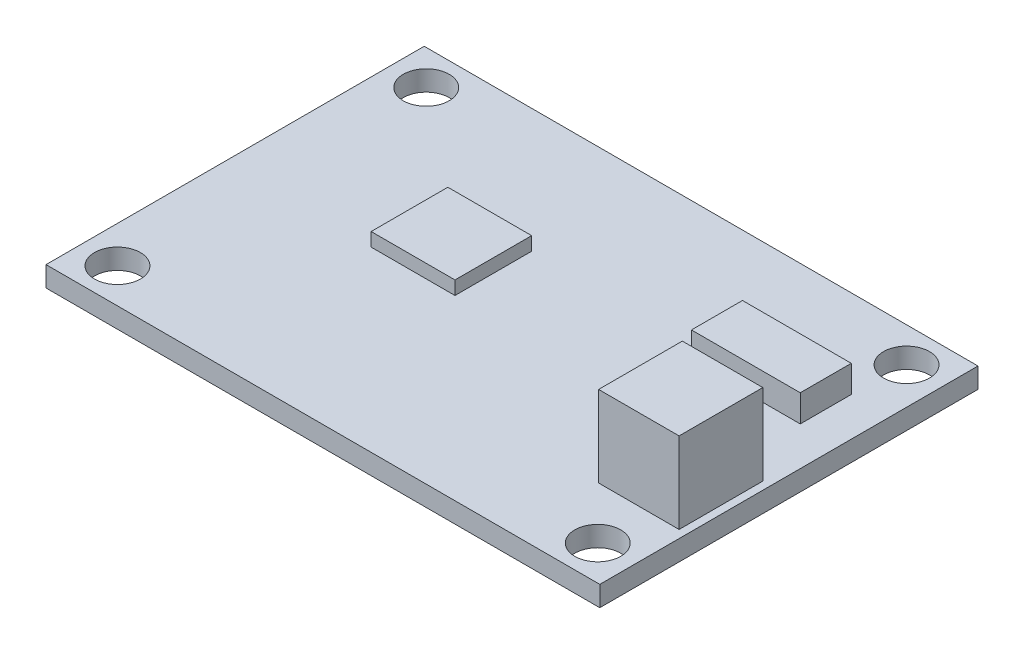
ISO-10303-21;
HEADER;
FILE_DESCRIPTION(('STEP AP214'),'2;1');
FILE_NAME('part.step','',(''),(''),'','','');
FILE_SCHEMA(('AUTOMOTIVE_DESIGN { 1 0 10303 214 1 1 1 1 }'));
ENDSEC;
DATA;
#1=APPLICATION_CONTEXT('core data for automotive mechanical design processes');
#2=APPLICATION_PROTOCOL_DEFINITION('international standard','automotive_design',2000,#1);
#3=PRODUCT_CONTEXT('',#1,'mechanical');
#4=PRODUCT('Part','Part','',(#3));
#5=PRODUCT_RELATED_PRODUCT_CATEGORY('part','',(#4));
#6=PRODUCT_DEFINITION_FORMATION('','',#4);
#7=PRODUCT_DEFINITION_CONTEXT('part definition',#1,'design');
#8=PRODUCT_DEFINITION('design','',#6,#7);
#9=PRODUCT_DEFINITION_SHAPE('','',#8);
#10=(LENGTH_UNIT() NAMED_UNIT(*) SI_UNIT(.MILLI.,.METRE.));
#11=(NAMED_UNIT(*) PLANE_ANGLE_UNIT() SI_UNIT($,.RADIAN.));
#12=(NAMED_UNIT(*) SI_UNIT($,.STERADIAN.) SOLID_ANGLE_UNIT());
#13=UNCERTAINTY_MEASURE_WITH_UNIT(LENGTH_MEASURE(1.E-05),#10,'distance_accuracy_value','');
#14=(GEOMETRIC_REPRESENTATION_CONTEXT(3) GLOBAL_UNCERTAINTY_ASSIGNED_CONTEXT((#13)) GLOBAL_UNIT_ASSIGNED_CONTEXT((#10,
#11,#12)) REPRESENTATION_CONTEXT('',''));
#15=CARTESIAN_POINT('',(0.,0.,0.));
#16=DIRECTION('',(0.,0.,1.));
#17=DIRECTION('',(1.,0.,0.));
#18=AXIS2_PLACEMENT_3D('',#15,#16,#17);
#19=CARTESIAN_POINT('',(0.,1.5,0.));
#20=DIRECTION('',(0.,1.,0.));
#21=DIRECTION('',(0.,0.,1.));
#22=AXIS2_PLACEMENT_3D('',#19,#20,#21);
#23=PLANE('',#22);
#24=DIRECTION('',(-1.,0.,0.));
#25=VECTOR('',#24,1.);
#26=CARTESIAN_POINT('',(13.9582344119431,1.5,1.34779727104624));
#27=LINE('',#26,#25);
#28=CARTESIAN_POINT('',(19.9164808427399,1.5,1.34779727104624));
#29=VERTEX_POINT('',#28);
#30=CARTESIAN_POINT('',(13.9582344119431,1.5,1.34779727104624));
#31=VERTEX_POINT('',#30);
#32=EDGE_CURVE('E177',#29,#31,#27,.T.);
#33=ORIENTED_EDGE('',*,*,#32,.F.);
#34=DIRECTION('',(0.,0.,-1.));
#35=VECTOR('',#34,1.);
#36=CARTESIAN_POINT('',(19.9164808427399,1.5,7.54614927527645));
#37=LINE('',#36,#35);
#38=CARTESIAN_POINT('',(19.9164808427399,1.5,7.54614927527645));
#39=VERTEX_POINT('',#38);
#40=EDGE_CURVE('E174',#39,#29,#37,.T.);
#41=ORIENTED_EDGE('',*,*,#40,.F.);
#42=DIRECTION('',(1.,0.,0.));
#43=VECTOR('',#42,1.);
#44=CARTESIAN_POINT('',(13.9582344119431,1.5,7.54614927527645));
#45=LINE('',#44,#43);
#46=CARTESIAN_POINT('',(13.9582344119431,1.5,7.54614927527645));
#47=VERTEX_POINT('',#46);
#48=EDGE_CURVE('E186',#47,#39,#45,.T.);
#49=ORIENTED_EDGE('',*,*,#48,.F.);
#50=DIRECTION('',(0.,0.,1.));
#51=VECTOR('',#50,1.);
#52=CARTESIAN_POINT('',(13.9582344119431,1.5,7.54614927527645));
#53=LINE('',#52,#51);
#54=EDGE_CURVE('E194',#31,#47,#53,.T.);
#55=ORIENTED_EDGE('',*,*,#54,.F.);
#56=EDGE_LOOP('',(#33,#41,#49,#55));
#57=FACE_BOUND('',#56,.T.);
#58=DIRECTION('',(0.,0.,1.));
#59=VECTOR('',#58,1.);
#60=CARTESIAN_POINT('',(-20.5,1.5,14.));
#61=LINE('',#60,#59);
#62=CARTESIAN_POINT('',(-20.5,1.5,-14.));
#63=VERTEX_POINT('',#62);
#64=CARTESIAN_POINT('',(-20.5,1.5,14.));
#65=VERTEX_POINT('',#64);
#66=EDGE_CURVE('E259',#63,#65,#61,.T.);
#67=ORIENTED_EDGE('',*,*,#66,.T.);
#68=DIRECTION('',(1.,0.,0.));
#69=VECTOR('',#68,1.);
#70=CARTESIAN_POINT('',(20.5,1.5,14.));
#71=LINE('',#70,#69);
#72=CARTESIAN_POINT('',(20.5,1.5,14.));
#73=VERTEX_POINT('',#72);
#74=EDGE_CURVE('E262',#65,#73,#71,.T.);
#75=ORIENTED_EDGE('',*,*,#74,.T.);
#76=DIRECTION('',(0.,0.,-1.));
#77=VECTOR('',#76,1.);
#78=CARTESIAN_POINT('',(20.5,1.5,14.));
#79=LINE('',#78,#77);
#80=CARTESIAN_POINT('',(20.5,1.5,-14.));
#81=VERTEX_POINT('',#80);
#82=EDGE_CURVE('E265',#73,#81,#79,.T.);
#83=ORIENTED_EDGE('',*,*,#82,.T.);
#84=DIRECTION('',(-1.,0.,0.));
#85=VECTOR('',#84,1.);
#86=CARTESIAN_POINT('',(20.5,1.5,-14.));
#87=LINE('',#86,#85);
#88=EDGE_CURVE('E267',#81,#63,#87,.T.);
#89=ORIENTED_EDGE('',*,*,#88,.T.);
#90=EDGE_LOOP('',(#67,#75,#83,#89));
#91=FACE_BOUND('',#90,.T.);
#92=CARTESIAN_POINT('',(-17.78,1.5,11.43));
#93=DIRECTION('',(0.,1.,0.));
#94=DIRECTION('',(0.,0.,1.));
#95=AXIS2_PLACEMENT_3D('',#92,#93,#94);
#96=CIRCLE('',#95,1.69999999999999);
#97=CARTESIAN_POINT('',(-17.78,1.5,13.13));
#98=VERTEX_POINT('',#97);
#99=EDGE_CURVE('E252',#98,#98,#96,.T.);
#100=ORIENTED_EDGE('',*,*,#99,.F.);
#101=EDGE_LOOP('',(#100));
#102=FACE_BOUND('',#101,.T.);
#103=CARTESIAN_POINT('',(-17.78,1.5,-11.43));
#104=DIRECTION('',(0.,1.,0.));
#105=DIRECTION('',(0.,0.,1.));
#106=AXIS2_PLACEMENT_3D('',#103,#104,#105);
#107=CIRCLE('',#106,1.69999999999999);
#108=CARTESIAN_POINT('',(-17.78,1.5,-9.73000000000001));
#109=VERTEX_POINT('',#108);
#110=EDGE_CURVE('E246',#109,#109,#107,.T.);
#111=ORIENTED_EDGE('',*,*,#110,.F.);
#112=EDGE_LOOP('',(#111));
#113=FACE_BOUND('',#112,.T.);
#114=CARTESIAN_POINT('',(17.78,1.5,-11.43));
#115=DIRECTION('',(0.,1.,0.));
#116=DIRECTION('',(0.,0.,1.));
#117=AXIS2_PLACEMENT_3D('',#114,#115,#116);
#118=CIRCLE('',#117,1.69999999999999);
#119=CARTESIAN_POINT('',(17.78,1.5,-9.73000000000001));
#120=VERTEX_POINT('',#119);
#121=EDGE_CURVE('E240',#120,#120,#118,.T.);
#122=ORIENTED_EDGE('',*,*,#121,.F.);
#123=EDGE_LOOP('',(#122));
#124=FACE_BOUND('',#123,.T.);
#125=CARTESIAN_POINT('',(17.78,1.5,11.43));
#126=DIRECTION('',(0.,1.,0.));
#127=DIRECTION('',(0.,0.,1.));
#128=AXIS2_PLACEMENT_3D('',#125,#126,#127);
#129=CIRCLE('',#128,1.69999999999999);
#130=CARTESIAN_POINT('',(17.78,1.5,13.13));
#131=VERTEX_POINT('',#130);
#132=EDGE_CURVE('E234',#131,#131,#129,.T.);
#133=ORIENTED_EDGE('',*,*,#132,.F.);
#134=EDGE_LOOP('',(#133));
#135=FACE_BOUND('',#134,.T.);
#136=DIRECTION('',(1.,0.,0.));
#137=VECTOR('',#136,1.);
#138=CARTESIAN_POINT('',(-3.37981137624865,1.5,0.842290377192967));
#139=LINE('',#138,#137);
#140=CARTESIAN_POINT('',(-9.58606358983616,1.5,0.842290377192967));
#141=VERTEX_POINT('',#140);
#142=CARTESIAN_POINT('',(-3.37981137624865,1.5,0.842290377192967));
#143=VERTEX_POINT('',#142);
#144=EDGE_CURVE('E219',#141,#143,#139,.T.);
#145=ORIENTED_EDGE('',*,*,#144,.F.);
#146=DIRECTION('',(0.,0.,1.));
#147=VECTOR('',#146,1.);
#148=CARTESIAN_POINT('',(-9.58606358983616,1.5,0.842290377192967));
#149=LINE('',#148,#147);
#150=CARTESIAN_POINT('',(-9.58606358983616,1.5,-4.83619911727828));
#151=VERTEX_POINT('',#150);
#152=EDGE_CURVE('E205',#151,#141,#149,.T.);
#153=ORIENTED_EDGE('',*,*,#152,.F.);
#154=DIRECTION('',(-1.,0.,0.));
#155=VECTOR('',#154,1.);
#156=CARTESIAN_POINT('',(-3.37981137624865,1.5,-4.83619911727828));
#157=LINE('',#156,#155);
#158=CARTESIAN_POINT('',(-3.37981137624865,1.5,-4.83619911727828));
#159=VERTEX_POINT('',#158);
#160=EDGE_CURVE('E210',#159,#151,#157,.T.);
#161=ORIENTED_EDGE('',*,*,#160,.F.);
#162=DIRECTION('',(0.,0.,-1.));
#163=VECTOR('',#162,1.);
#164=CARTESIAN_POINT('',(-3.37981137624865,1.5,0.842290377192967));
#165=LINE('',#164,#163);
#166=EDGE_CURVE('E221',#143,#159,#165,.T.);
#167=ORIENTED_EDGE('',*,*,#166,.F.);
#168=EDGE_LOOP('',(#145,#153,#161,#167));
#169=FACE_BOUND('',#168,.T.);
#170=DIRECTION('',(-1.,0.,0.));
#171=VECTOR('',#170,1.);
#172=CARTESIAN_POINT('',(9.5809906280806,1.5,-7.48192015925042));
#173=LINE('',#172,#171);
#174=CARTESIAN_POINT('',(17.6360530402917,1.5,-7.48192015925042));
#175=VERTEX_POINT('',#174);
#176=CARTESIAN_POINT('',(9.5809906280806,1.5,-7.48192015925042));
#177=VERTEX_POINT('',#176);
#178=EDGE_CURVE('E571',#175,#177,#173,.T.);
#179=ORIENTED_EDGE('',*,*,#178,.F.);
#180=DIRECTION('',(0.,0.,-1.));
#181=VECTOR('',#180,1.);
#182=CARTESIAN_POINT('',(17.6360530402917,1.5,-7.48192015925042));
#183=LINE('',#182,#181);
#184=CARTESIAN_POINT('',(17.6360530402917,1.5,-3.70478470995295));
#185=VERTEX_POINT('',#184);
#186=EDGE_CURVE('E172',#185,#175,#183,.T.);
#187=ORIENTED_EDGE('',*,*,#186,.F.);
#188=DIRECTION('',(1.,0.,0.));
#189=VECTOR('',#188,1.);
#190=CARTESIAN_POINT('',(9.5809906280806,1.5,-3.70478470995295));
#191=LINE('',#190,#189);
#192=CARTESIAN_POINT('',(9.5809906280806,1.5,-3.70478470995295));
#193=VERTEX_POINT('',#192);
#194=EDGE_CURVE('E168',#193,#185,#191,.T.);
#195=ORIENTED_EDGE('',*,*,#194,.F.);
#196=DIRECTION('',(0.,0.,1.));
#197=VECTOR('',#196,1.);
#198=CARTESIAN_POINT('',(9.5809906280806,1.5,-7.48192015925042));
#199=LINE('',#198,#197);
#200=EDGE_CURVE('E568',#177,#193,#199,.T.);
#201=ORIENTED_EDGE('',*,*,#200,.F.);
#202=EDGE_LOOP('',(#179,#187,#195,#201));
#203=FACE_BOUND('',#202,.T.);
#204=ADVANCED_FACE('F35',(#57,#91,#102,#113,#124,#135,#169,#203),#23,.T.);
#205=CARTESIAN_POINT('',(-20.5,1.5,14.));
#206=DIRECTION('',(1.,0.,0.));
#207=DIRECTION('',(0.,0.,-1.));
#208=AXIS2_PLACEMENT_3D('',#205,#206,#207);
#209=PLANE('',#208);
#210=DIRECTION('',(0.,0.,1.));
#211=VECTOR('',#210,1.);
#212=CARTESIAN_POINT('',(-20.5,0.,14.));
#213=LINE('',#212,#211);
#214=CARTESIAN_POINT('',(-20.5,0.,-14.));
#215=VERTEX_POINT('',#214);
#216=CARTESIAN_POINT('',(-20.5,0.,14.));
#217=VERTEX_POINT('',#216);
#218=EDGE_CURVE('E258',#215,#217,#213,.T.);
#219=ORIENTED_EDGE('',*,*,#218,.T.);
#220=DIRECTION('',(0.,-1.,0.));
#221=VECTOR('',#220,1.);
#222=CARTESIAN_POINT('',(-20.5,1.5,14.));
#223=LINE('',#222,#221);
#224=EDGE_CURVE('E11',#65,#217,#223,.T.);
#225=ORIENTED_EDGE('',*,*,#224,.F.);
#226=ORIENTED_EDGE('',*,*,#66,.F.);
#227=DIRECTION('',(0.,-1.,0.));
#228=VECTOR('',#227,1.);
#229=CARTESIAN_POINT('',(-20.5,1.5,-14.));
#230=LINE('',#229,#228);
#231=EDGE_CURVE('E269',#63,#215,#230,.T.);
#232=ORIENTED_EDGE('',*,*,#231,.T.);
#233=EDGE_LOOP('',(#219,#225,#226,#232));
#234=FACE_BOUND('',#233,.T.);
#235=ADVANCED_FACE('F37',(#234),#209,.F.);
#236=CARTESIAN_POINT('',(20.5,1.5,14.));
#237=DIRECTION('',(0.,0.,-1.));
#238=DIRECTION('',(-1.,0.,0.));
#239=AXIS2_PLACEMENT_3D('',#236,#237,#238);
#240=PLANE('',#239);
#241=DIRECTION('',(1.,0.,0.));
#242=VECTOR('',#241,1.);
#243=CARTESIAN_POINT('',(20.5,0.,14.));
#244=LINE('',#243,#242);
#245=CARTESIAN_POINT('',(20.5,0.,14.));
#246=VERTEX_POINT('',#245);
#247=EDGE_CURVE('E272',#217,#246,#244,.T.);
#248=ORIENTED_EDGE('',*,*,#247,.T.);
#249=DIRECTION('',(0.,-1.,0.));
#250=VECTOR('',#249,1.);
#251=CARTESIAN_POINT('',(20.5,1.5,14.));
#252=LINE('',#251,#250);
#253=EDGE_CURVE('E43',#73,#246,#252,.T.);
#254=ORIENTED_EDGE('',*,*,#253,.F.);
#255=ORIENTED_EDGE('',*,*,#74,.F.);
#256=ORIENTED_EDGE('',*,*,#224,.T.);
#257=EDGE_LOOP('',(#248,#254,#255,#256));
#258=FACE_BOUND('',#257,.T.);
#259=ADVANCED_FACE('F302',(#258),#240,.F.);
#260=CARTESIAN_POINT('',(20.5,1.5,14.));
#261=DIRECTION('',(-1.,0.,0.));
#262=DIRECTION('',(0.,0.,1.));
#263=AXIS2_PLACEMENT_3D('',#260,#261,#262);
#264=PLANE('',#263);
#265=DIRECTION('',(0.,0.,-1.));
#266=VECTOR('',#265,1.);
#267=CARTESIAN_POINT('',(20.5,0.,14.));
#268=LINE('',#267,#266);
#269=CARTESIAN_POINT('',(20.5,0.,-14.));
#270=VERTEX_POINT('',#269);
#271=EDGE_CURVE('E274',#246,#270,#268,.T.);
#272=ORIENTED_EDGE('',*,*,#271,.T.);
#273=DIRECTION('',(0.,-1.,0.));
#274=VECTOR('',#273,1.);
#275=CARTESIAN_POINT('',(20.5,1.5,-14.));
#276=LINE('',#275,#274);
#277=EDGE_CURVE('E279',#81,#270,#276,.T.);
#278=ORIENTED_EDGE('',*,*,#277,.F.);
#279=ORIENTED_EDGE('',*,*,#82,.F.);
#280=ORIENTED_EDGE('',*,*,#253,.T.);
#281=EDGE_LOOP('',(#272,#278,#279,#280));
#282=FACE_BOUND('',#281,.T.);
#283=ADVANCED_FACE('F286',(#282),#264,.F.);
#284=CARTESIAN_POINT('',(20.5,1.5,-14.));
#285=DIRECTION('',(0.,0.,1.));
#286=DIRECTION('',(1.,0.,0.));
#287=AXIS2_PLACEMENT_3D('',#284,#285,#286);
#288=PLANE('',#287);
#289=DIRECTION('',(-1.,0.,0.));
#290=VECTOR('',#289,1.);
#291=CARTESIAN_POINT('',(20.5,0.,-14.));
#292=LINE('',#291,#290);
#293=EDGE_CURVE('E263',#270,#215,#292,.T.);
#294=ORIENTED_EDGE('',*,*,#293,.T.);
#295=ORIENTED_EDGE('',*,*,#231,.F.);
#296=ORIENTED_EDGE('',*,*,#88,.F.);
#297=ORIENTED_EDGE('',*,*,#277,.T.);
#298=EDGE_LOOP('',(#294,#295,#296,#297));
#299=FACE_BOUND('',#298,.T.);
#300=ADVANCED_FACE('F295',(#299),#288,.F.);
#301=CARTESIAN_POINT('',(0.,0.,0.));
#302=DIRECTION('',(0.,1.,0.));
#303=DIRECTION('',(0.,0.,1.));
#304=AXIS2_PLACEMENT_3D('',#301,#302,#303);
#305=PLANE('',#304);
#306=CARTESIAN_POINT('',(17.78,0.,11.43));
#307=DIRECTION('',(0.,1.,0.));
#308=DIRECTION('',(0.,0.,1.));
#309=AXIS2_PLACEMENT_3D('',#306,#307,#308);
#310=CIRCLE('',#309,1.7);
#311=CARTESIAN_POINT('',(17.78,0.,13.13));
#312=VERTEX_POINT('',#311);
#313=EDGE_CURVE('E237',#312,#312,#310,.T.);
#314=ORIENTED_EDGE('',*,*,#313,.T.);
#315=EDGE_LOOP('',(#314));
#316=FACE_BOUND('',#315,.T.);
#317=CARTESIAN_POINT('',(17.78,0.,-11.43));
#318=DIRECTION('',(0.,1.,0.));
#319=DIRECTION('',(0.,0.,1.));
#320=AXIS2_PLACEMENT_3D('',#317,#318,#319);
#321=CIRCLE('',#320,1.7);
#322=CARTESIAN_POINT('',(17.78,0.,-9.73));
#323=VERTEX_POINT('',#322);
#324=EDGE_CURVE('E243',#323,#323,#321,.T.);
#325=ORIENTED_EDGE('',*,*,#324,.T.);
#326=EDGE_LOOP('',(#325));
#327=FACE_BOUND('',#326,.T.);
#328=CARTESIAN_POINT('',(-17.78,0.,-11.43));
#329=DIRECTION('',(0.,1.,0.));
#330=DIRECTION('',(0.,0.,1.));
#331=AXIS2_PLACEMENT_3D('',#328,#329,#330);
#332=CIRCLE('',#331,1.7);
#333=CARTESIAN_POINT('',(-17.78,0.,-9.73));
#334=VERTEX_POINT('',#333);
#335=EDGE_CURVE('E249',#334,#334,#332,.T.);
#336=ORIENTED_EDGE('',*,*,#335,.T.);
#337=EDGE_LOOP('',(#336));
#338=FACE_BOUND('',#337,.T.);
#339=CARTESIAN_POINT('',(-17.78,0.,11.43));
#340=DIRECTION('',(0.,1.,0.));
#341=DIRECTION('',(0.,0.,1.));
#342=AXIS2_PLACEMENT_3D('',#339,#340,#341);
#343=CIRCLE('',#342,1.7);
#344=CARTESIAN_POINT('',(-17.78,0.,13.13));
#345=VERTEX_POINT('',#344);
#346=EDGE_CURVE('E255',#345,#345,#343,.T.);
#347=ORIENTED_EDGE('',*,*,#346,.T.);
#348=EDGE_LOOP('',(#347));
#349=FACE_BOUND('',#348,.T.);
#350=ORIENTED_EDGE('',*,*,#218,.F.);
#351=ORIENTED_EDGE('',*,*,#293,.F.);
#352=ORIENTED_EDGE('',*,*,#271,.F.);
#353=ORIENTED_EDGE('',*,*,#247,.F.);
#354=EDGE_LOOP('',(#350,#351,#352,#353));
#355=FACE_BOUND('',#354,.T.);
#356=ADVANCED_FACE('F292',(#316,#327,#338,#349,#355),#305,.F.);
#357=CARTESIAN_POINT('',(-17.78,1.5,11.43));
#358=DIRECTION('',(0.,1.,0.));
#359=DIRECTION('',(0.,0.,1.));
#360=AXIS2_PLACEMENT_3D('',#357,#358,#359);
#361=CYLINDRICAL_SURFACE('',#360,1.69999999999999);
#362=ORIENTED_EDGE('',*,*,#346,.F.);
#363=EDGE_LOOP('',(#362));
#364=FACE_BOUND('',#363,.T.);
#365=ORIENTED_EDGE('',*,*,#99,.T.);
#366=EDGE_LOOP('',(#365));
#367=FACE_BOUND('',#366,.T.);
#368=ADVANCED_FACE('F317',(#364,#367),#361,.F.);
#369=CARTESIAN_POINT('',(-17.78,1.5,-11.43));
#370=DIRECTION('',(0.,1.,0.));
#371=DIRECTION('',(0.,0.,1.));
#372=AXIS2_PLACEMENT_3D('',#369,#370,#371);
#373=CYLINDRICAL_SURFACE('',#372,1.69999999999999);
#374=ORIENTED_EDGE('',*,*,#335,.F.);
#375=EDGE_LOOP('',(#374));
#376=FACE_BOUND('',#375,.T.);
#377=ORIENTED_EDGE('',*,*,#110,.T.);
#378=EDGE_LOOP('',(#377));
#379=FACE_BOUND('',#378,.T.);
#380=ADVANCED_FACE('F337',(#376,#379),#373,.F.);
#381=CARTESIAN_POINT('',(17.78,1.5,-11.43));
#382=DIRECTION('',(0.,1.,0.));
#383=DIRECTION('',(0.,0.,1.));
#384=AXIS2_PLACEMENT_3D('',#381,#382,#383);
#385=CYLINDRICAL_SURFACE('',#384,1.69999999999999);
#386=ORIENTED_EDGE('',*,*,#324,.F.);
#387=EDGE_LOOP('',(#386));
#388=FACE_BOUND('',#387,.T.);
#389=ORIENTED_EDGE('',*,*,#121,.T.);
#390=EDGE_LOOP('',(#389));
#391=FACE_BOUND('',#390,.T.);
#392=ADVANCED_FACE('F344',(#388,#391),#385,.F.);
#393=CARTESIAN_POINT('',(17.78,1.5,11.43));
#394=DIRECTION('',(0.,1.,0.));
#395=DIRECTION('',(0.,0.,1.));
#396=AXIS2_PLACEMENT_3D('',#393,#394,#395);
#397=CYLINDRICAL_SURFACE('',#396,1.69999999999999);
#398=ORIENTED_EDGE('',*,*,#313,.F.);
#399=EDGE_LOOP('',(#398));
#400=FACE_BOUND('',#399,.T.);
#401=ORIENTED_EDGE('',*,*,#132,.T.);
#402=EDGE_LOOP('',(#401));
#403=FACE_BOUND('',#402,.T.);
#404=ADVANCED_FACE('F351',(#400,#403),#397,.F.);
#405=CARTESIAN_POINT('',(-9.58606358983616,2.5,0.842290377192967));
#406=DIRECTION('',(1.,0.,0.));
#407=DIRECTION('',(0.,0.,-1.));
#408=AXIS2_PLACEMENT_3D('',#405,#406,#407);
#409=PLANE('',#408);
#410=ORIENTED_EDGE('',*,*,#152,.T.);
#411=DIRECTION('',(0.,-1.,0.));
#412=VECTOR('',#411,1.);
#413=CARTESIAN_POINT('',(-9.58606358983616,2.5,0.842290377192967));
#414=LINE('',#413,#412);
#415=CARTESIAN_POINT('',(-9.58606358983616,2.5,0.842290377192967));
#416=VERTEX_POINT('',#415);
#417=EDGE_CURVE('E232',#416,#141,#414,.T.);
#418=ORIENTED_EDGE('',*,*,#417,.F.);
#419=DIRECTION('',(0.,0.,1.));
#420=VECTOR('',#419,1.);
#421=CARTESIAN_POINT('',(-9.58606358983616,2.5,0.842290377192967));
#422=LINE('',#421,#420);
#423=CARTESIAN_POINT('',(-9.58606358983616,2.5,-4.83619911727828));
#424=VERTEX_POINT('',#423);
#425=EDGE_CURVE('E206',#424,#416,#422,.T.);
#426=ORIENTED_EDGE('',*,*,#425,.F.);
#427=DIRECTION('',(0.,-1.,0.));
#428=VECTOR('',#427,1.);
#429=CARTESIAN_POINT('',(-9.58606358983616,2.5,-4.83619911727828));
#430=LINE('',#429,#428);
#431=EDGE_CURVE('E216',#424,#151,#430,.T.);
#432=ORIENTED_EDGE('',*,*,#431,.T.);
#433=EDGE_LOOP('',(#410,#418,#426,#432));
#434=FACE_BOUND('',#433,.T.);
#435=ADVANCED_FACE('F359',(#434),#409,.F.);
#436=CARTESIAN_POINT('',(-3.37981137624865,2.5,0.842290377192967));
#437=DIRECTION('',(0.,0.,-1.));
#438=DIRECTION('',(-1.,0.,0.));
#439=AXIS2_PLACEMENT_3D('',#436,#437,#438);
#440=PLANE('',#439);
#441=ORIENTED_EDGE('',*,*,#144,.T.);
#442=DIRECTION('',(0.,-1.,0.));
#443=VECTOR('',#442,1.);
#444=CARTESIAN_POINT('',(-3.37981137624865,2.5,0.842290377192967));
#445=LINE('',#444,#443);
#446=CARTESIAN_POINT('',(-3.37981137624865,2.5,0.842290377192967));
#447=VERTEX_POINT('',#446);
#448=EDGE_CURVE('E229',#447,#143,#445,.T.);
#449=ORIENTED_EDGE('',*,*,#448,.F.);
#450=DIRECTION('',(1.,0.,0.));
#451=VECTOR('',#450,1.);
#452=CARTESIAN_POINT('',(-3.37981137624865,2.5,0.842290377192967));
#453=LINE('',#452,#451);
#454=EDGE_CURVE('E209',#416,#447,#453,.T.);
#455=ORIENTED_EDGE('',*,*,#454,.F.);
#456=ORIENTED_EDGE('',*,*,#417,.T.);
#457=EDGE_LOOP('',(#441,#449,#455,#456));
#458=FACE_BOUND('',#457,.T.);
#459=ADVANCED_FACE('F368',(#458),#440,.F.);
#460=CARTESIAN_POINT('',(-3.37981137624865,2.5,0.842290377192967));
#461=DIRECTION('',(-1.,0.,0.));
#462=DIRECTION('',(0.,0.,1.));
#463=AXIS2_PLACEMENT_3D('',#460,#461,#462);
#464=PLANE('',#463);
#465=ORIENTED_EDGE('',*,*,#166,.T.);
#466=DIRECTION('',(0.,-1.,0.));
#467=VECTOR('',#466,1.);
#468=CARTESIAN_POINT('',(-3.37981137624865,2.5,-4.83619911727828));
#469=LINE('',#468,#467);
#470=CARTESIAN_POINT('',(-3.37981137624865,2.5,-4.83619911727828));
#471=VERTEX_POINT('',#470);
#472=EDGE_CURVE('E227',#471,#159,#469,.T.);
#473=ORIENTED_EDGE('',*,*,#472,.F.);
#474=DIRECTION('',(0.,0.,-1.));
#475=VECTOR('',#474,1.);
#476=CARTESIAN_POINT('',(-3.37981137624865,2.5,0.842290377192967));
#477=LINE('',#476,#475);
#478=EDGE_CURVE('E212',#447,#471,#477,.T.);
#479=ORIENTED_EDGE('',*,*,#478,.F.);
#480=ORIENTED_EDGE('',*,*,#448,.T.);
#481=EDGE_LOOP('',(#465,#473,#479,#480));
#482=FACE_BOUND('',#481,.T.);
#483=ADVANCED_FACE('F376',(#482),#464,.F.);
#484=CARTESIAN_POINT('',(-3.37981137624865,2.5,-4.83619911727828));
#485=DIRECTION('',(0.,0.,1.));
#486=DIRECTION('',(1.,0.,0.));
#487=AXIS2_PLACEMENT_3D('',#484,#485,#486);
#488=PLANE('',#487);
#489=ORIENTED_EDGE('',*,*,#160,.T.);
#490=ORIENTED_EDGE('',*,*,#431,.F.);
#491=DIRECTION('',(-1.,0.,0.));
#492=VECTOR('',#491,1.);
#493=CARTESIAN_POINT('',(-3.37981137624865,2.5,-4.83619911727828));
#494=LINE('',#493,#492);
#495=EDGE_CURVE('E214',#471,#424,#494,.T.);
#496=ORIENTED_EDGE('',*,*,#495,.F.);
#497=ORIENTED_EDGE('',*,*,#472,.T.);
#498=EDGE_LOOP('',(#489,#490,#496,#497));
#499=FACE_BOUND('',#498,.T.);
#500=ADVANCED_FACE('F385',(#499),#488,.F.);
#501=CARTESIAN_POINT('',(0.,2.5,0.));
#502=DIRECTION('',(0.,1.,0.));
#503=DIRECTION('',(0.,0.,1.));
#504=AXIS2_PLACEMENT_3D('',#501,#502,#503);
#505=PLANE('',#504);
#506=ORIENTED_EDGE('',*,*,#425,.T.);
#507=ORIENTED_EDGE('',*,*,#454,.T.);
#508=ORIENTED_EDGE('',*,*,#478,.T.);
#509=ORIENTED_EDGE('',*,*,#495,.T.);
#510=EDGE_LOOP('',(#506,#507,#508,#509));
#511=FACE_BOUND('',#510,.T.);
#512=ADVANCED_FACE('F392',(#511),#505,.T.);
#513=CARTESIAN_POINT('',(19.9164808427399,7.5,7.54614927527645));
#514=DIRECTION('',(-1.,0.,0.));
#515=DIRECTION('',(0.,0.,1.));
#516=AXIS2_PLACEMENT_3D('',#513,#514,#515);
#517=PLANE('',#516);
#518=ORIENTED_EDGE('',*,*,#40,.T.);
#519=DIRECTION('',(0.,-1.,0.));
#520=VECTOR('',#519,1.);
#521=CARTESIAN_POINT('',(19.9164808427399,7.5,1.34779727104624));
#522=LINE('',#521,#520);
#523=CARTESIAN_POINT('',(19.9164808427399,7.5,1.34779727104624));
#524=VERTEX_POINT('',#523);
#525=EDGE_CURVE('E203',#524,#29,#522,.T.);
#526=ORIENTED_EDGE('',*,*,#525,.F.);
#527=DIRECTION('',(0.,0.,-1.));
#528=VECTOR('',#527,1.);
#529=CARTESIAN_POINT('',(19.9164808427399,7.5,7.54614927527645));
#530=LINE('',#529,#528);
#531=CARTESIAN_POINT('',(19.9164808427399,7.5,7.54614927527645));
#532=VERTEX_POINT('',#531);
#533=EDGE_CURVE('E182',#532,#524,#530,.T.);
#534=ORIENTED_EDGE('',*,*,#533,.F.);
#535=DIRECTION('',(0.,-1.,0.));
#536=VECTOR('',#535,1.);
#537=CARTESIAN_POINT('',(19.9164808427399,7.5,7.54614927527645));
#538=LINE('',#537,#536);
#539=EDGE_CURVE('E191',#532,#39,#538,.T.);
#540=ORIENTED_EDGE('',*,*,#539,.T.);
#541=EDGE_LOOP('',(#518,#526,#534,#540));
#542=FACE_BOUND('',#541,.T.);
#543=ADVANCED_FACE('F399',(#542),#517,.F.);
#544=CARTESIAN_POINT('',(13.9582344119431,7.5,1.34779727104624));
#545=DIRECTION('',(0.,0.,1.));
#546=DIRECTION('',(1.,0.,0.));
#547=AXIS2_PLACEMENT_3D('',#544,#545,#546);
#548=PLANE('',#547);
#549=ORIENTED_EDGE('',*,*,#32,.T.);
#550=DIRECTION('',(0.,-1.,0.));
#551=VECTOR('',#550,1.);
#552=CARTESIAN_POINT('',(13.9582344119431,7.5,1.34779727104624));
#553=LINE('',#552,#551);
#554=CARTESIAN_POINT('',(13.9582344119431,7.5,1.34779727104624));
#555=VERTEX_POINT('',#554);
#556=EDGE_CURVE('E200',#555,#31,#553,.T.);
#557=ORIENTED_EDGE('',*,*,#556,.F.);
#558=DIRECTION('',(-1.,0.,0.));
#559=VECTOR('',#558,1.);
#560=CARTESIAN_POINT('',(13.9582344119431,7.5,1.34779727104624));
#561=LINE('',#560,#559);
#562=EDGE_CURVE('E185',#524,#555,#561,.T.);
#563=ORIENTED_EDGE('',*,*,#562,.F.);
#564=ORIENTED_EDGE('',*,*,#525,.T.);
#565=EDGE_LOOP('',(#549,#557,#563,#564));
#566=FACE_BOUND('',#565,.T.);
#567=ADVANCED_FACE('F408',(#566),#548,.F.);
#568=CARTESIAN_POINT('',(13.9582344119431,7.5,7.54614927527645));
#569=DIRECTION('',(1.,0.,0.));
#570=DIRECTION('',(0.,0.,-1.));
#571=AXIS2_PLACEMENT_3D('',#568,#569,#570);
#572=PLANE('',#571);
#573=ORIENTED_EDGE('',*,*,#54,.T.);
#574=DIRECTION('',(0.,-1.,0.));
#575=VECTOR('',#574,1.);
#576=CARTESIAN_POINT('',(13.9582344119431,7.5,7.54614927527645));
#577=LINE('',#576,#575);
#578=CARTESIAN_POINT('',(13.9582344119431,7.5,7.54614927527645));
#579=VERTEX_POINT('',#578);
#580=EDGE_CURVE('E58',#579,#47,#577,.T.);
#581=ORIENTED_EDGE('',*,*,#580,.F.);
#582=DIRECTION('',(0.,0.,1.));
#583=VECTOR('',#582,1.);
#584=CARTESIAN_POINT('',(13.9582344119431,7.5,7.54614927527645));
#585=LINE('',#584,#583);
#586=EDGE_CURVE('E188',#555,#579,#585,.T.);
#587=ORIENTED_EDGE('',*,*,#586,.F.);
#588=ORIENTED_EDGE('',*,*,#556,.T.);
#589=EDGE_LOOP('',(#573,#581,#587,#588));
#590=FACE_BOUND('',#589,.T.);
#591=ADVANCED_FACE('F418',(#590),#572,.F.);
#592=CARTESIAN_POINT('',(13.9582344119431,7.5,7.54614927527645));
#593=DIRECTION('',(0.,0.,-1.));
#594=DIRECTION('',(-1.,0.,0.));
#595=AXIS2_PLACEMENT_3D('',#592,#593,#594);
#596=PLANE('',#595);
#597=ORIENTED_EDGE('',*,*,#48,.T.);
#598=ORIENTED_EDGE('',*,*,#539,.F.);
#599=DIRECTION('',(1.,0.,0.));
#600=VECTOR('',#599,1.);
#601=CARTESIAN_POINT('',(13.9582344119431,7.5,7.54614927527645));
#602=LINE('',#601,#600);
#603=EDGE_CURVE('E190',#579,#532,#602,.T.);
#604=ORIENTED_EDGE('',*,*,#603,.F.);
#605=ORIENTED_EDGE('',*,*,#580,.T.);
#606=EDGE_LOOP('',(#597,#598,#604,#605));
#607=FACE_BOUND('',#606,.T.);
#608=ADVANCED_FACE('F426',(#607),#596,.F.);
#609=CARTESIAN_POINT('',(0.,7.5,0.));
#610=DIRECTION('',(0.,-1.,0.));
#611=DIRECTION('',(0.,0.,-1.));
#612=AXIS2_PLACEMENT_3D('',#609,#610,#611);
#613=PLANE('',#612);
#614=ORIENTED_EDGE('',*,*,#533,.T.);
#615=ORIENTED_EDGE('',*,*,#562,.T.);
#616=ORIENTED_EDGE('',*,*,#586,.T.);
#617=ORIENTED_EDGE('',*,*,#603,.T.);
#618=EDGE_LOOP('',(#614,#615,#616,#617));
#619=FACE_BOUND('',#618,.T.);
#620=ADVANCED_FACE('F433',(#619),#613,.F.);
#621=CARTESIAN_POINT('',(17.6360530402917,3.5,-7.48192015925042));
#622=DIRECTION('',(-1.,0.,0.));
#623=DIRECTION('',(0.,0.,1.));
#624=AXIS2_PLACEMENT_3D('',#621,#622,#623);
#625=PLANE('',#624);
#626=ORIENTED_EDGE('',*,*,#186,.T.);
#627=DIRECTION('',(0.,-1.,0.));
#628=VECTOR('',#627,1.);
#629=CARTESIAN_POINT('',(17.6360530402917,3.5,-7.48192015925042));
#630=LINE('',#629,#628);
#631=CARTESIAN_POINT('',(17.6360530402917,3.5,-7.48192015925042));
#632=VERTEX_POINT('',#631);
#633=EDGE_CURVE('E153',#632,#175,#630,.T.);
#634=ORIENTED_EDGE('',*,*,#633,.F.);
#635=DIRECTION('',(0.,0.,-1.));
#636=VECTOR('',#635,1.);
#637=CARTESIAN_POINT('',(17.6360530402917,3.5,-7.48192015925042));
#638=LINE('',#637,#636);
#639=CARTESIAN_POINT('',(17.6360530402917,3.5,-3.70478470995295));
#640=VERTEX_POINT('',#639);
#641=EDGE_CURVE('E160',#640,#632,#638,.T.);
#642=ORIENTED_EDGE('',*,*,#641,.F.);
#643=DIRECTION('',(0.,-1.,0.));
#644=VECTOR('',#643,1.);
#645=CARTESIAN_POINT('',(17.6360530402917,3.5,-3.70478470995295));
#646=LINE('',#645,#644);
#647=EDGE_CURVE('E565',#640,#185,#646,.T.);
#648=ORIENTED_EDGE('',*,*,#647,.T.);
#649=EDGE_LOOP('',(#626,#634,#642,#648));
#650=FACE_BOUND('',#649,.T.);
#651=ADVANCED_FACE('F170',(#650),#625,.F.);
#652=CARTESIAN_POINT('',(9.5809906280806,3.5,-7.48192015925042));
#653=DIRECTION('',(0.,0.,1.));
#654=DIRECTION('',(1.,0.,0.));
#655=AXIS2_PLACEMENT_3D('',#652,#653,#654);
#656=PLANE('',#655);
#657=ORIENTED_EDGE('',*,*,#178,.T.);
#658=DIRECTION('',(0.,-1.,0.));
#659=VECTOR('',#658,1.);
#660=CARTESIAN_POINT('',(9.5809906280806,3.5,-7.48192015925042));
#661=LINE('',#660,#659);
#662=CARTESIAN_POINT('',(9.5809906280806,3.5,-7.48192015925042));
#663=VERTEX_POINT('',#662);
#664=EDGE_CURVE('E156',#663,#177,#661,.T.);
#665=ORIENTED_EDGE('',*,*,#664,.F.);
#666=DIRECTION('',(-1.,0.,0.));
#667=VECTOR('',#666,1.);
#668=CARTESIAN_POINT('',(9.5809906280806,3.5,-7.48192015925042));
#669=LINE('',#668,#667);
#670=EDGE_CURVE('E149',#632,#663,#669,.T.);
#671=ORIENTED_EDGE('',*,*,#670,.F.);
#672=ORIENTED_EDGE('',*,*,#633,.T.);
#673=EDGE_LOOP('',(#657,#665,#671,#672));
#674=FACE_BOUND('',#673,.T.);
#675=ADVANCED_FACE('F151',(#674),#656,.F.);
#676=CARTESIAN_POINT('',(9.5809906280806,3.5,-7.48192015925042));
#677=DIRECTION('',(1.,0.,0.));
#678=DIRECTION('',(0.,0.,-1.));
#679=AXIS2_PLACEMENT_3D('',#676,#677,#678);
#680=PLANE('',#679);
#681=ORIENTED_EDGE('',*,*,#200,.T.);
#682=DIRECTION('',(0.,-1.,0.));
#683=VECTOR('',#682,1.);
#684=CARTESIAN_POINT('',(9.5809906280806,3.5,-3.70478470995295));
#685=LINE('',#684,#683);
#686=CARTESIAN_POINT('',(9.5809906280806,3.5,-3.70478470995295));
#687=VERTEX_POINT('',#686);
#688=EDGE_CURVE('E50',#687,#193,#685,.T.);
#689=ORIENTED_EDGE('',*,*,#688,.F.);
#690=DIRECTION('',(0.,0.,1.));
#691=VECTOR('',#690,1.);
#692=CARTESIAN_POINT('',(9.5809906280806,3.5,-7.48192015925042));
#693=LINE('',#692,#691);
#694=EDGE_CURVE('E159',#663,#687,#693,.T.);
#695=ORIENTED_EDGE('',*,*,#694,.F.);
#696=ORIENTED_EDGE('',*,*,#664,.T.);
#697=EDGE_LOOP('',(#681,#689,#695,#696));
#698=FACE_BOUND('',#697,.T.);
#699=ADVANCED_FACE('F454',(#698),#680,.F.);
#700=CARTESIAN_POINT('',(9.5809906280806,3.5,-3.70478470995295));
#701=DIRECTION('',(0.,0.,-1.));
#702=DIRECTION('',(-1.,0.,0.));
#703=AXIS2_PLACEMENT_3D('',#700,#701,#702);
#704=PLANE('',#703);
#705=ORIENTED_EDGE('',*,*,#194,.T.);
#706=ORIENTED_EDGE('',*,*,#647,.F.);
#707=DIRECTION('',(1.,0.,0.));
#708=VECTOR('',#707,1.);
#709=CARTESIAN_POINT('',(9.5809906280806,3.5,-3.70478470995295));
#710=LINE('',#709,#708);
#711=EDGE_CURVE('E164',#687,#640,#710,.T.);
#712=ORIENTED_EDGE('',*,*,#711,.F.);
#713=ORIENTED_EDGE('',*,*,#688,.T.);
#714=EDGE_LOOP('',(#705,#706,#712,#713));
#715=FACE_BOUND('',#714,.T.);
#716=ADVANCED_FACE('F460',(#715),#704,.F.);
#717=CARTESIAN_POINT('',(0.,3.5,0.));
#718=DIRECTION('',(0.,1.,0.));
#719=DIRECTION('',(0.,0.,1.));
#720=AXIS2_PLACEMENT_3D('',#717,#718,#719);
#721=PLANE('',#720);
#722=ORIENTED_EDGE('',*,*,#641,.T.);
#723=ORIENTED_EDGE('',*,*,#670,.T.);
#724=ORIENTED_EDGE('',*,*,#694,.T.);
#725=ORIENTED_EDGE('',*,*,#711,.T.);
#726=EDGE_LOOP('',(#722,#723,#724,#725));
#727=FACE_BOUND('',#726,.T.);
#728=ADVANCED_FACE('F163',(#727),#721,.T.);
#729=CLOSED_SHELL('',(#204,#235,#259,#283,#300,#356,#368,#380,#392,#404,#435,#459,#483,#500,
#512,#543,#567,#591,#608,#620,#651,#675,#699,#716,#728));
#730=MANIFOLD_SOLID_BREP('B2',#729);
#731=ADVANCED_BREP_SHAPE_REPRESENTATION('',(#18,#730),#14);
#732=SHAPE_DEFINITION_REPRESENTATION(#9,#731);
ENDSEC;
END-ISO-10303-21;
